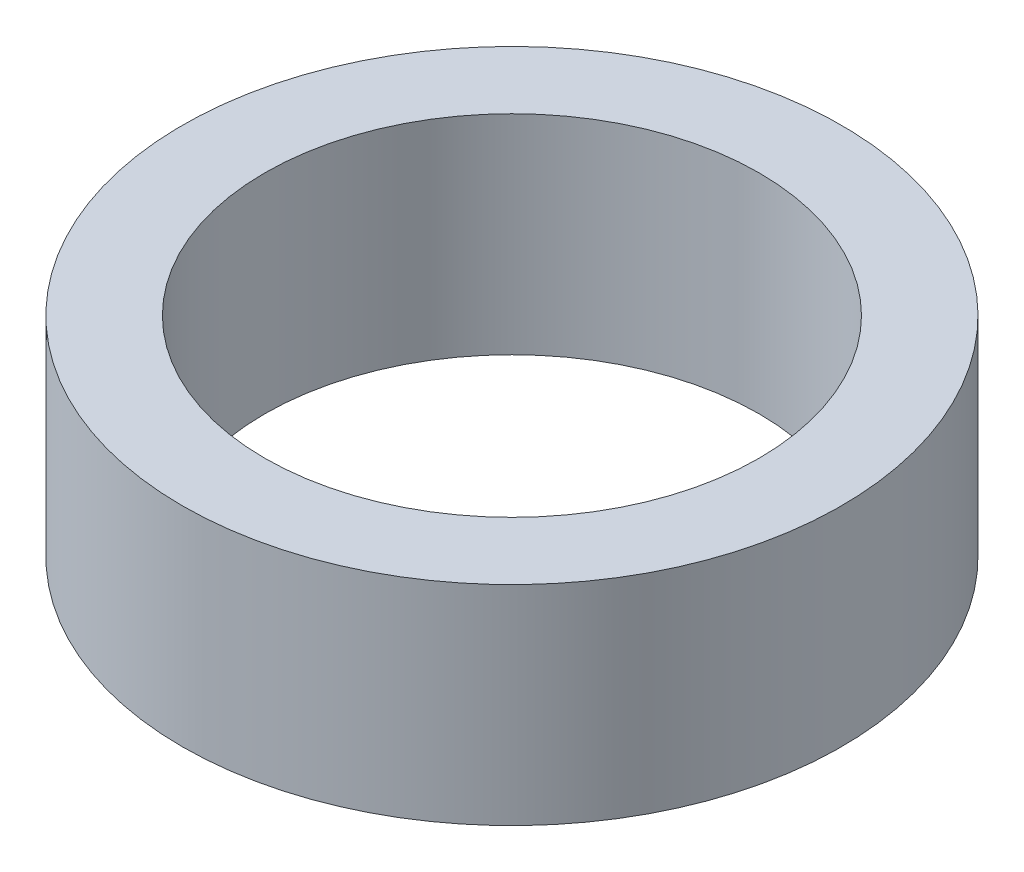
ISO-10303-21;
HEADER;
FILE_DESCRIPTION(('STEP AP214'),'2;1');
FILE_NAME('part.step','',(''),(''),'','','');
FILE_SCHEMA(('AUTOMOTIVE_DESIGN { 1 0 10303 214 1 1 1 1 }'));
ENDSEC;
DATA;
#1=APPLICATION_CONTEXT('core data for automotive mechanical design processes');
#2=APPLICATION_PROTOCOL_DEFINITION('international standard','automotive_design',2000,#1);
#3=PRODUCT_CONTEXT('',#1,'mechanical');
#4=PRODUCT('Part','Part','',(#3));
#5=PRODUCT_RELATED_PRODUCT_CATEGORY('part','',(#4));
#6=PRODUCT_DEFINITION_FORMATION('','',#4);
#7=PRODUCT_DEFINITION_CONTEXT('part definition',#1,'design');
#8=PRODUCT_DEFINITION('design','',#6,#7);
#9=PRODUCT_DEFINITION_SHAPE('','',#8);
#10=(LENGTH_UNIT() NAMED_UNIT(*) SI_UNIT(.MILLI.,.METRE.));
#11=(NAMED_UNIT(*) PLANE_ANGLE_UNIT() SI_UNIT($,.RADIAN.));
#12=(NAMED_UNIT(*) SI_UNIT($,.STERADIAN.) SOLID_ANGLE_UNIT());
#13=UNCERTAINTY_MEASURE_WITH_UNIT(LENGTH_MEASURE(1.E-05),#10,'distance_accuracy_value','');
#14=(GEOMETRIC_REPRESENTATION_CONTEXT(3) GLOBAL_UNCERTAINTY_ASSIGNED_CONTEXT((#13)) GLOBAL_UNIT_ASSIGNED_CONTEXT((#10,
#11,#12)) REPRESENTATION_CONTEXT('',''));
#15=CARTESIAN_POINT('',(0.,0.,0.));
#16=DIRECTION('',(0.,0.,1.));
#17=DIRECTION('',(1.,0.,0.));
#18=AXIS2_PLACEMENT_3D('',#15,#16,#17);
#19=CARTESIAN_POINT('',(0.,19.,0.));
#20=DIRECTION('',(0.,-1.,0.));
#21=DIRECTION('',(0.,0.,-1.));
#22=AXIS2_PLACEMENT_3D('',#19,#20,#21);
#23=CYLINDRICAL_SURFACE('',#22,30.);
#24=CARTESIAN_POINT('',(0.,19.,0.));
#25=DIRECTION('',(0.,1.,0.));
#26=DIRECTION('',(0.,0.,1.));
#27=AXIS2_PLACEMENT_3D('',#24,#25,#26);
#28=CIRCLE('',#27,30.);
#29=CARTESIAN_POINT('',(0.,19.,30.));
#30=VERTEX_POINT('',#29);
#31=EDGE_CURVE('E10',#30,#30,#28,.T.);
#32=ORIENTED_EDGE('',*,*,#31,.F.);
#33=EDGE_LOOP('',(#32));
#34=FACE_BOUND('',#33,.T.);
#35=CARTESIAN_POINT('',(0.,0.,0.));
#36=DIRECTION('',(0.,1.,0.));
#37=DIRECTION('',(0.,0.,1.));
#38=AXIS2_PLACEMENT_3D('',#35,#36,#37);
#39=CIRCLE('',#38,30.);
#40=CARTESIAN_POINT('',(0.,0.,30.));
#41=VERTEX_POINT('',#40);
#42=EDGE_CURVE('E37',#41,#41,#39,.T.);
#43=ORIENTED_EDGE('',*,*,#42,.T.);
#44=EDGE_LOOP('',(#43));
#45=FACE_BOUND('',#44,.T.);
#46=ADVANCED_FACE('F40',(#34,#45),#23,.T.);
#47=CARTESIAN_POINT('',(0.,19.,0.));
#48=DIRECTION('',(0.,1.,0.));
#49=DIRECTION('',(0.,0.,1.));
#50=AXIS2_PLACEMENT_3D('',#47,#48,#49);
#51=PLANE('',#50);
#52=CARTESIAN_POINT('',(0.,19.,0.));
#53=DIRECTION('',(0.,1.,0.));
#54=DIRECTION('',(0.,0.,1.));
#55=AXIS2_PLACEMENT_3D('',#52,#53,#54);
#56=CIRCLE('',#55,22.5);
#57=CARTESIAN_POINT('',(0.,19.,22.5));
#58=VERTEX_POINT('',#57);
#59=EDGE_CURVE('E50',#58,#58,#56,.T.);
#60=ORIENTED_EDGE('',*,*,#59,.F.);
#61=EDGE_LOOP('',(#60));
#62=FACE_BOUND('',#61,.T.);
#63=ORIENTED_EDGE('',*,*,#31,.T.);
#64=EDGE_LOOP('',(#63));
#65=FACE_BOUND('',#64,.T.);
#66=ADVANCED_FACE('F59',(#62,#65),#51,.T.);
#67=CARTESIAN_POINT('',(0.,0.,0.));
#68=DIRECTION('',(0.,1.,0.));
#69=DIRECTION('',(0.,0.,1.));
#70=AXIS2_PLACEMENT_3D('',#67,#68,#69);
#71=PLANE('',#70);
#72=CARTESIAN_POINT('',(0.,0.,0.));
#73=DIRECTION('',(0.,1.,0.));
#74=DIRECTION('',(0.,0.,1.));
#75=AXIS2_PLACEMENT_3D('',#72,#73,#74);
#76=CIRCLE('',#75,22.5);
#77=CARTESIAN_POINT('',(0.,0.,22.5));
#78=VERTEX_POINT('',#77);
#79=EDGE_CURVE('E47',#78,#78,#76,.T.);
#80=ORIENTED_EDGE('',*,*,#79,.T.);
#81=EDGE_LOOP('',(#80));
#82=FACE_BOUND('',#81,.T.);
#83=ORIENTED_EDGE('',*,*,#42,.F.);
#84=EDGE_LOOP('',(#83));
#85=FACE_BOUND('',#84,.T.);
#86=ADVANCED_FACE('F58',(#82,#85),#71,.F.);
#87=CARTESIAN_POINT('',(0.,19.,0.));
#88=DIRECTION('',(0.,-1.,0.));
#89=DIRECTION('',(0.,0.,-1.));
#90=AXIS2_PLACEMENT_3D('',#87,#88,#89);
#91=CYLINDRICAL_SURFACE('',#90,22.5);
#92=ORIENTED_EDGE('',*,*,#59,.T.);
#93=EDGE_LOOP('',(#92));
#94=FACE_BOUND('',#93,.T.);
#95=ORIENTED_EDGE('',*,*,#79,.F.);
#96=EDGE_LOOP('',(#95));
#97=FACE_BOUND('',#96,.T.);
#98=ADVANCED_FACE('F54',(#94,#97),#91,.F.);
#99=CLOSED_SHELL('',(#46,#66,#86,#98));
#100=MANIFOLD_SOLID_BREP('B2',#99);
#101=ADVANCED_BREP_SHAPE_REPRESENTATION('',(#18,#100),#14);
#102=SHAPE_DEFINITION_REPRESENTATION(#9,#101);
ENDSEC;
END-ISO-10303-21;
